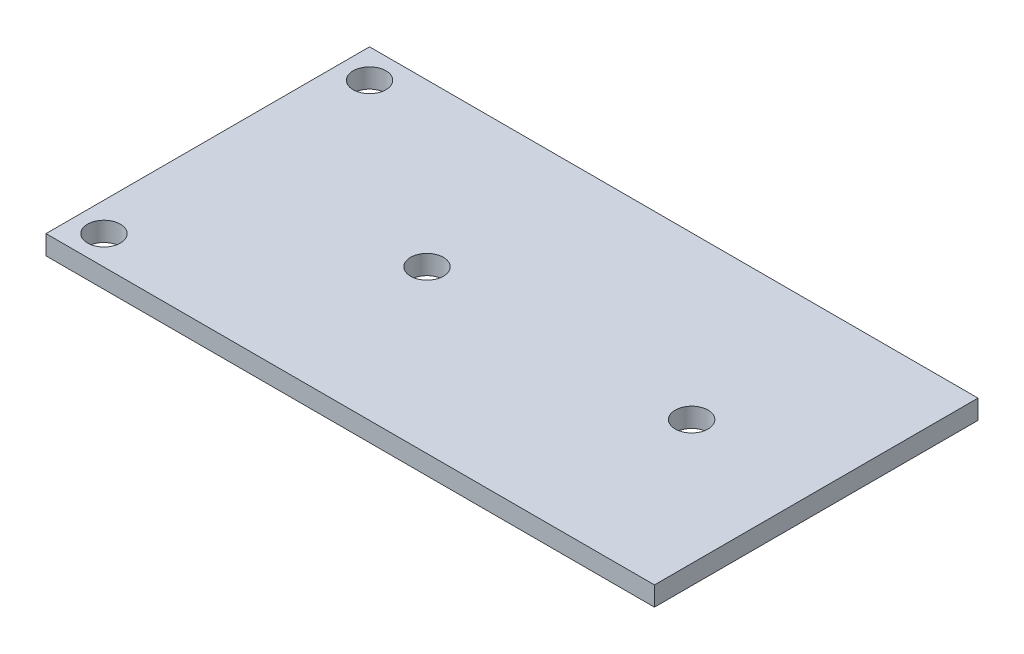
ISO-10303-21;
HEADER;
FILE_DESCRIPTION(('STEP AP214'),'2;1');
FILE_NAME('part.step','',(''),(''),'','','');
FILE_SCHEMA(('AUTOMOTIVE_DESIGN { 1 0 10303 214 1 1 1 1 }'));
ENDSEC;
DATA;
#1=APPLICATION_CONTEXT('core data for automotive mechanical design processes');
#2=APPLICATION_PROTOCOL_DEFINITION('international standard','automotive_design',2000,#1);
#3=PRODUCT_CONTEXT('',#1,'mechanical');
#4=PRODUCT('Part','Part','',(#3));
#5=PRODUCT_RELATED_PRODUCT_CATEGORY('part','',(#4));
#6=PRODUCT_DEFINITION_FORMATION('','',#4);
#7=PRODUCT_DEFINITION_CONTEXT('part definition',#1,'design');
#8=PRODUCT_DEFINITION('design','',#6,#7);
#9=PRODUCT_DEFINITION_SHAPE('','',#8);
#10=(LENGTH_UNIT() NAMED_UNIT(*) SI_UNIT(.MILLI.,.METRE.));
#11=(NAMED_UNIT(*) PLANE_ANGLE_UNIT() SI_UNIT($,.RADIAN.));
#12=(NAMED_UNIT(*) SI_UNIT($,.STERADIAN.) SOLID_ANGLE_UNIT());
#13=UNCERTAINTY_MEASURE_WITH_UNIT(LENGTH_MEASURE(1.E-05),#10,'distance_accuracy_value','');
#14=(GEOMETRIC_REPRESENTATION_CONTEXT(3) GLOBAL_UNCERTAINTY_ASSIGNED_CONTEXT((#13)) GLOBAL_UNIT_ASSIGNED_CONTEXT((#10,
#11,#12)) REPRESENTATION_CONTEXT('',''));
#15=CARTESIAN_POINT('',(0.,0.,0.));
#16=DIRECTION('',(0.,0.,1.));
#17=DIRECTION('',(1.,0.,0.));
#18=AXIS2_PLACEMENT_3D('',#15,#16,#17);
#19=CARTESIAN_POINT('',(-72.1860853564312,2.,3.00554810025348));
#20=DIRECTION('',(0.,0.,-1.));
#21=DIRECTION('',(-1.,0.,0.));
#22=AXIS2_PLACEMENT_3D('',#19,#20,#21);
#23=PLANE('',#22);
#24=DIRECTION('',(1.,0.,0.));
#25=VECTOR('',#24,1.);
#26=CARTESIAN_POINT('',(-72.1860853564312,2.,3.00554810025348));
#27=LINE('',#26,#25);
#28=CARTESIAN_POINT('',(-70.1860853564312,2.,3.00554810025348));
#29=VERTEX_POINT('',#28);
#30=CARTESIAN_POINT('',(-7.1860853564312,2.,3.00554810025348));
#31=VERTEX_POINT('',#30);
#32=EDGE_CURVE('E86',#29,#31,#27,.T.);
#33=ORIENTED_EDGE('',*,*,#32,.F.);
#34=DIRECTION('',(0.,-1.,0.));
#35=VECTOR('',#34,1.);
#36=CARTESIAN_POINT('',(-70.1860853564312,2.,3.00554810025348));
#37=LINE('',#36,#35);
#38=CARTESIAN_POINT('',(-70.1860853564312,0.,3.00554810025348));
#39=VERTEX_POINT('',#38);
#40=EDGE_CURVE('E117',#29,#39,#37,.T.);
#41=ORIENTED_EDGE('',*,*,#40,.T.);
#42=DIRECTION('',(1.,0.,0.));
#43=VECTOR('',#42,1.);
#44=CARTESIAN_POINT('',(-72.1860853564312,0.,3.00554810025348));
#45=LINE('',#44,#43);
#46=CARTESIAN_POINT('',(-7.1860853564312,0.,3.00554810025348));
#47=VERTEX_POINT('',#46);
#48=EDGE_CURVE('E78',#39,#47,#45,.T.);
#49=ORIENTED_EDGE('',*,*,#48,.T.);
#50=DIRECTION('',(0.,-1.,0.));
#51=VECTOR('',#50,1.);
#52=CARTESIAN_POINT('',(-7.1860853564312,2.,3.00554810025348));
#53=LINE('',#52,#51);
#54=EDGE_CURVE('E11',#31,#47,#53,.T.);
#55=ORIENTED_EDGE('',*,*,#54,.F.);
#56=EDGE_LOOP('',(#33,#41,#49,#55));
#57=FACE_BOUND('',#56,.T.);
#58=ADVANCED_FACE('F34',(#57),#23,.F.);
#59=CARTESIAN_POINT('',(-7.1860853564312,2.,-30.4944518997465));
#60=DIRECTION('',(-1.,0.,0.));
#61=DIRECTION('',(0.,0.,1.));
#62=AXIS2_PLACEMENT_3D('',#59,#60,#61);
#63=PLANE('',#62);
#64=DIRECTION('',(0.,0.,-1.));
#65=VECTOR('',#64,1.);
#66=CARTESIAN_POINT('',(-7.1860853564312,0.,-30.4944518997465));
#67=LINE('',#66,#65);
#68=CARTESIAN_POINT('',(-7.1860853564312,0.,-30.4944518997465));
#69=VERTEX_POINT('',#68);
#70=EDGE_CURVE('E69',#47,#69,#67,.T.);
#71=ORIENTED_EDGE('',*,*,#70,.T.);
#72=DIRECTION('',(0.,-1.,0.));
#73=VECTOR('',#72,1.);
#74=CARTESIAN_POINT('',(-7.1860853564312,2.,-30.4944518997465));
#75=LINE('',#74,#73);
#76=CARTESIAN_POINT('',(-7.1860853564312,2.,-30.4944518997465));
#77=VERTEX_POINT('',#76);
#78=EDGE_CURVE('E41',#77,#69,#75,.T.);
#79=ORIENTED_EDGE('',*,*,#78,.F.);
#80=DIRECTION('',(0.,0.,-1.));
#81=VECTOR('',#80,1.);
#82=CARTESIAN_POINT('',(-7.1860853564312,2.,-30.4944518997465));
#83=LINE('',#82,#81);
#84=EDGE_CURVE('E57',#31,#77,#83,.T.);
#85=ORIENTED_EDGE('',*,*,#84,.F.);
#86=ORIENTED_EDGE('',*,*,#54,.T.);
#87=EDGE_LOOP('',(#71,#79,#85,#86));
#88=FACE_BOUND('',#87,.T.);
#89=ADVANCED_FACE('F71',(#88),#63,.F.);
#90=CARTESIAN_POINT('',(-72.1860853564312,2.,-30.4944518997465));
#91=DIRECTION('',(0.,0.,1.));
#92=DIRECTION('',(1.,0.,0.));
#93=AXIS2_PLACEMENT_3D('',#90,#91,#92);
#94=PLANE('',#93);
#95=DIRECTION('',(-1.,0.,0.));
#96=VECTOR('',#95,1.);
#97=CARTESIAN_POINT('',(-72.1860853564312,0.,-30.4944518997465));
#98=LINE('',#97,#96);
#99=CARTESIAN_POINT('',(-70.1860853564312,0.,-30.4944518997465));
#100=VERTEX_POINT('',#99);
#101=EDGE_CURVE('E77',#69,#100,#98,.T.);
#102=ORIENTED_EDGE('',*,*,#101,.T.);
#103=DIRECTION('',(0.,-1.,0.));
#104=VECTOR('',#103,1.);
#105=CARTESIAN_POINT('',(-70.1860853564312,2.,-30.4944518997465));
#106=LINE('',#105,#104);
#107=CARTESIAN_POINT('',(-70.1860853564312,2.,-30.4944518997465));
#108=VERTEX_POINT('',#107);
#109=EDGE_CURVE('E48',#108,#100,#106,.T.);
#110=ORIENTED_EDGE('',*,*,#109,.F.);
#111=DIRECTION('',(-1.,0.,0.));
#112=VECTOR('',#111,1.);
#113=CARTESIAN_POINT('',(-72.1860853564312,2.,-30.4944518997465));
#114=LINE('',#113,#112);
#115=EDGE_CURVE('E83',#77,#108,#114,.T.);
#116=ORIENTED_EDGE('',*,*,#115,.F.);
#117=ORIENTED_EDGE('',*,*,#78,.T.);
#118=EDGE_LOOP('',(#102,#110,#116,#117));
#119=FACE_BOUND('',#118,.T.);
#120=ADVANCED_FACE('F82',(#119),#94,.F.);
#121=CARTESIAN_POINT('',(0.,2.,0.));
#122=DIRECTION('',(0.,1.,0.));
#123=DIRECTION('',(0.,0.,1.));
#124=AXIS2_PLACEMENT_3D('',#121,#122,#123);
#125=PLANE('',#124);
#126=DIRECTION('',(0.,0.,1.));
#127=VECTOR('',#126,1.);
#128=CARTESIAN_POINT('',(-70.1860853564312,2.,-30.4944518997465));
#129=LINE('',#128,#127);
#130=EDGE_CURVE('E119',#108,#29,#129,.T.);
#131=ORIENTED_EDGE('',*,*,#130,.T.);
#132=ORIENTED_EDGE('',*,*,#32,.T.);
#133=ORIENTED_EDGE('',*,*,#84,.T.);
#134=ORIENTED_EDGE('',*,*,#115,.T.);
#135=EDGE_LOOP('',(#131,#132,#133,#134));
#136=FACE_BOUND('',#135,.T.);
#137=CARTESIAN_POINT('',(-47.4860853564312,2.,-13.7444518997465));
#138=DIRECTION('',(0.,1.,0.));
#139=DIRECTION('',(0.,0.,1.));
#140=AXIS2_PLACEMENT_3D('',#137,#138,#139);
#141=CIRCLE('',#140,1.69999999999999);
#142=CARTESIAN_POINT('',(-47.4860853564312,2.,-12.0444518997465));
#143=VERTEX_POINT('',#142);
#144=EDGE_CURVE('E114',#143,#143,#141,.T.);
#145=ORIENTED_EDGE('',*,*,#144,.F.);
#146=EDGE_LOOP('',(#145));
#147=FACE_BOUND('',#146,.T.);
#148=CARTESIAN_POINT('',(-20.0860853564312,2.,-13.7444518997465));
#149=DIRECTION('',(0.,1.,0.));
#150=DIRECTION('',(0.,0.,1.));
#151=AXIS2_PLACEMENT_3D('',#148,#149,#150);
#152=CIRCLE('',#151,1.69999999999999);
#153=CARTESIAN_POINT('',(-20.0860853564312,2.,-12.0444518997465));
#154=VERTEX_POINT('',#153);
#155=EDGE_CURVE('E108',#154,#154,#152,.T.);
#156=ORIENTED_EDGE('',*,*,#155,.F.);
#157=EDGE_LOOP('',(#156));
#158=FACE_BOUND('',#157,.T.);
#159=CARTESIAN_POINT('',(-67.1860853564312,2.,-27.4944518997465));
#160=DIRECTION('',(0.,1.,0.));
#161=DIRECTION('',(0.,0.,1.));
#162=AXIS2_PLACEMENT_3D('',#159,#160,#161);
#163=CIRCLE('',#162,1.69999999999999);
#164=CARTESIAN_POINT('',(-67.1860853564312,2.,-25.7944518997465));
#165=VERTEX_POINT('',#164);
#166=EDGE_CURVE('E102',#165,#165,#163,.T.);
#167=ORIENTED_EDGE('',*,*,#166,.F.);
#168=EDGE_LOOP('',(#167));
#169=FACE_BOUND('',#168,.T.);
#170=CARTESIAN_POINT('',(-67.1860853564312,2.,0.00554810025348278));
#171=DIRECTION('',(0.,1.,0.));
#172=DIRECTION('',(0.,0.,1.));
#173=AXIS2_PLACEMENT_3D('',#170,#171,#172);
#174=CIRCLE('',#173,1.69999999999999);
#175=CARTESIAN_POINT('',(-67.1860853564312,2.,1.70554810025348));
#176=VERTEX_POINT('',#175);
#177=EDGE_CURVE('E96',#176,#176,#174,.T.);
#178=ORIENTED_EDGE('',*,*,#177,.F.);
#179=EDGE_LOOP('',(#178));
#180=FACE_BOUND('',#179,.T.);
#181=ADVANCED_FACE('F125',(#136,#147,#158,#169,#180),#125,.T.);
#182=CARTESIAN_POINT('',(0.,0.,0.));
#183=DIRECTION('',(0.,1.,0.));
#184=DIRECTION('',(0.,0.,1.));
#185=AXIS2_PLACEMENT_3D('',#182,#183,#184);
#186=PLANE('',#185);
#187=CARTESIAN_POINT('',(-47.4860853564312,0.,-13.7444518997465));
#188=DIRECTION('',(0.,1.,0.));
#189=DIRECTION('',(0.,0.,1.));
#190=AXIS2_PLACEMENT_3D('',#187,#188,#189);
#191=CIRCLE('',#190,1.7);
#192=CARTESIAN_POINT('',(-47.4860853564312,0.,-12.0444518997465));
#193=VERTEX_POINT('',#192);
#194=EDGE_CURVE('E111',#193,#193,#191,.T.);
#195=ORIENTED_EDGE('',*,*,#194,.T.);
#196=EDGE_LOOP('',(#195));
#197=FACE_BOUND('',#196,.T.);
#198=CARTESIAN_POINT('',(-20.0860853564312,0.,-13.7444518997465));
#199=DIRECTION('',(0.,1.,0.));
#200=DIRECTION('',(0.,0.,1.));
#201=AXIS2_PLACEMENT_3D('',#198,#199,#200);
#202=CIRCLE('',#201,1.7);
#203=CARTESIAN_POINT('',(-20.0860853564312,0.,-12.0444518997465));
#204=VERTEX_POINT('',#203);
#205=EDGE_CURVE('E105',#204,#204,#202,.T.);
#206=ORIENTED_EDGE('',*,*,#205,.T.);
#207=EDGE_LOOP('',(#206));
#208=FACE_BOUND('',#207,.T.);
#209=CARTESIAN_POINT('',(-67.1860853564312,0.,-27.4944518997465));
#210=DIRECTION('',(0.,1.,0.));
#211=DIRECTION('',(0.,0.,1.));
#212=AXIS2_PLACEMENT_3D('',#209,#210,#211);
#213=CIRCLE('',#212,1.69999999999999);
#214=CARTESIAN_POINT('',(-67.1860853564312,0.,-25.7944518997465));
#215=VERTEX_POINT('',#214);
#216=EDGE_CURVE('E99',#215,#215,#213,.T.);
#217=ORIENTED_EDGE('',*,*,#216,.T.);
#218=EDGE_LOOP('',(#217));
#219=FACE_BOUND('',#218,.T.);
#220=CARTESIAN_POINT('',(-67.1860853564312,0.,0.00554810025348278));
#221=DIRECTION('',(0.,1.,0.));
#222=DIRECTION('',(0.,0.,1.));
#223=AXIS2_PLACEMENT_3D('',#220,#221,#222);
#224=CIRCLE('',#223,1.69999999999999);
#225=CARTESIAN_POINT('',(-67.1860853564312,0.,1.70554810025348));
#226=VERTEX_POINT('',#225);
#227=EDGE_CURVE('E91',#226,#226,#224,.T.);
#228=ORIENTED_EDGE('',*,*,#227,.T.);
#229=EDGE_LOOP('',(#228));
#230=FACE_BOUND('',#229,.T.);
#231=ORIENTED_EDGE('',*,*,#48,.F.);
#232=DIRECTION('',(0.,0.,1.));
#233=VECTOR('',#232,1.);
#234=CARTESIAN_POINT('',(-70.1860853564312,0.,-30.4944518997465));
#235=LINE('',#234,#233);
#236=EDGE_CURVE('E85',#100,#39,#235,.T.);
#237=ORIENTED_EDGE('',*,*,#236,.F.);
#238=ORIENTED_EDGE('',*,*,#101,.F.);
#239=ORIENTED_EDGE('',*,*,#70,.F.);
#240=EDGE_LOOP('',(#231,#237,#238,#239));
#241=FACE_BOUND('',#240,.T.);
#242=ADVANCED_FACE('F84',(#197,#208,#219,#230,#241),#186,.F.);
#243=CARTESIAN_POINT('',(-67.1860853564312,2.,0.00554810025348278));
#244=DIRECTION('',(0.,1.,0.));
#245=DIRECTION('',(0.,0.,1.));
#246=AXIS2_PLACEMENT_3D('',#243,#244,#245);
#247=CYLINDRICAL_SURFACE('',#246,1.69999999999999);
#248=ORIENTED_EDGE('',*,*,#227,.F.);
#249=EDGE_LOOP('',(#248));
#250=FACE_BOUND('',#249,.T.);
#251=ORIENTED_EDGE('',*,*,#177,.T.);
#252=EDGE_LOOP('',(#251));
#253=FACE_BOUND('',#252,.T.);
#254=ADVANCED_FACE('F154',(#250,#253),#247,.F.);
#255=CARTESIAN_POINT('',(-67.1860853564312,2.,-27.4944518997465));
#256=DIRECTION('',(0.,1.,0.));
#257=DIRECTION('',(0.,0.,1.));
#258=AXIS2_PLACEMENT_3D('',#255,#256,#257);
#259=CYLINDRICAL_SURFACE('',#258,1.69999999999999);
#260=ORIENTED_EDGE('',*,*,#216,.F.);
#261=EDGE_LOOP('',(#260));
#262=FACE_BOUND('',#261,.T.);
#263=ORIENTED_EDGE('',*,*,#166,.T.);
#264=EDGE_LOOP('',(#263));
#265=FACE_BOUND('',#264,.T.);
#266=ADVANCED_FACE('F160',(#262,#265),#259,.F.);
#267=CARTESIAN_POINT('',(-20.0860853564312,2.,-13.7444518997465));
#268=DIRECTION('',(0.,1.,0.));
#269=DIRECTION('',(0.,0.,1.));
#270=AXIS2_PLACEMENT_3D('',#267,#268,#269);
#271=CYLINDRICAL_SURFACE('',#270,1.69999999999999);
#272=ORIENTED_EDGE('',*,*,#205,.F.);
#273=EDGE_LOOP('',(#272));
#274=FACE_BOUND('',#273,.T.);
#275=ORIENTED_EDGE('',*,*,#155,.T.);
#276=EDGE_LOOP('',(#275));
#277=FACE_BOUND('',#276,.T.);
#278=ADVANCED_FACE('F140',(#274,#277),#271,.F.);
#279=CARTESIAN_POINT('',(-47.4860853564312,2.,-13.7444518997465));
#280=DIRECTION('',(0.,1.,0.));
#281=DIRECTION('',(0.,0.,1.));
#282=AXIS2_PLACEMENT_3D('',#279,#280,#281);
#283=CYLINDRICAL_SURFACE('',#282,1.69999999999999);
#284=ORIENTED_EDGE('',*,*,#194,.F.);
#285=EDGE_LOOP('',(#284));
#286=FACE_BOUND('',#285,.T.);
#287=ORIENTED_EDGE('',*,*,#144,.T.);
#288=EDGE_LOOP('',(#287));
#289=FACE_BOUND('',#288,.T.);
#290=ADVANCED_FACE('F135',(#286,#289),#283,.F.);
#291=CARTESIAN_POINT('',(-70.1860853564312,2.,-30.4944518997465));
#292=DIRECTION('',(1.,0.,0.));
#293=DIRECTION('',(0.,0.,-1.));
#294=AXIS2_PLACEMENT_3D('',#291,#292,#293);
#295=PLANE('',#294);
#296=ORIENTED_EDGE('',*,*,#236,.T.);
#297=ORIENTED_EDGE('',*,*,#40,.F.);
#298=ORIENTED_EDGE('',*,*,#130,.F.);
#299=ORIENTED_EDGE('',*,*,#109,.T.);
#300=EDGE_LOOP('',(#296,#297,#298,#299));
#301=FACE_BOUND('',#300,.T.);
#302=ADVANCED_FACE('F133',(#301),#295,.F.);
#303=CLOSED_SHELL('',(#58,#89,#120,#181,#242,#254,#266,#278,#290,#302));
#304=MANIFOLD_SOLID_BREP('B2',#303);
#305=ADVANCED_BREP_SHAPE_REPRESENTATION('',(#18,#304),#14);
#306=SHAPE_DEFINITION_REPRESENTATION(#9,#305);
ENDSEC;
END-ISO-10303-21;
